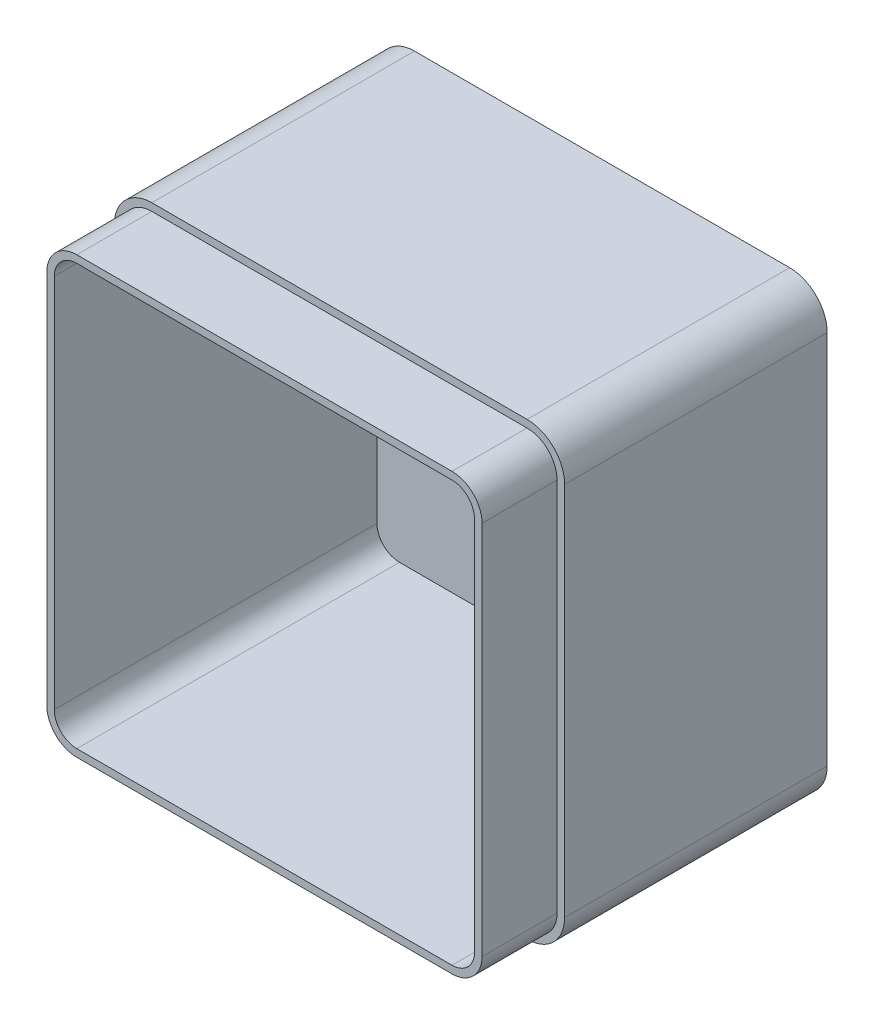
ISO-10303-21;
HEADER;
FILE_DESCRIPTION(('STEP AP214'),'2;1');
FILE_NAME('part.step','',(''),(''),'','','');
FILE_SCHEMA(('AUTOMOTIVE_DESIGN { 1 0 10303 214 1 1 1 1 }'));
ENDSEC;
DATA;
#1=APPLICATION_CONTEXT('core data for automotive mechanical design processes');
#2=APPLICATION_PROTOCOL_DEFINITION('international standard','automotive_design',2000,#1);
#3=PRODUCT_CONTEXT('',#1,'mechanical');
#4=PRODUCT('Part','Part','',(#3));
#5=PRODUCT_RELATED_PRODUCT_CATEGORY('part','',(#4));
#6=PRODUCT_DEFINITION_FORMATION('','',#4);
#7=PRODUCT_DEFINITION_CONTEXT('part definition',#1,'design');
#8=PRODUCT_DEFINITION('design','',#6,#7);
#9=PRODUCT_DEFINITION_SHAPE('','',#8);
#10=(LENGTH_UNIT() NAMED_UNIT(*) SI_UNIT(.MILLI.,.METRE.));
#11=(NAMED_UNIT(*) PLANE_ANGLE_UNIT() SI_UNIT($,.RADIAN.));
#12=(NAMED_UNIT(*) SI_UNIT($,.STERADIAN.) SOLID_ANGLE_UNIT());
#13=UNCERTAINTY_MEASURE_WITH_UNIT(LENGTH_MEASURE(1.E-05),#10,'distance_accuracy_value','');
#14=(GEOMETRIC_REPRESENTATION_CONTEXT(3) GLOBAL_UNCERTAINTY_ASSIGNED_CONTEXT((#13)) GLOBAL_UNIT_ASSIGNED_CONTEXT((#10,
#11,#12)) REPRESENTATION_CONTEXT('',''));
#15=CARTESIAN_POINT('',(0.,0.,0.));
#16=DIRECTION('',(0.,0.,1.));
#17=DIRECTION('',(1.,0.,0.));
#18=AXIS2_PLACEMENT_3D('',#15,#16,#17);
#19=CARTESIAN_POINT('',(0.,0.,4.));
#20=DIRECTION('',(0.,0.,-1.));
#21=DIRECTION('',(-1.,0.,0.));
#22=AXIS2_PLACEMENT_3D('',#19,#20,#21);
#23=PLANE('',#22);
#24=DIRECTION('',(-1.,0.,0.));
#25=VECTOR('',#24,1.);
#26=CARTESIAN_POINT('',(0.,4.,4.));
#27=LINE('',#26,#25);
#28=CARTESIAN_POINT('',(-10.,4.,4.));
#29=VERTEX_POINT('',#28);
#30=CARTESIAN_POINT('',(-110.,4.,4.));
#31=VERTEX_POINT('',#30);
#32=EDGE_CURVE('E805',#29,#31,#27,.T.);
#33=ORIENTED_EDGE('',*,*,#32,.F.);
#34=CARTESIAN_POINT('',(-10.,10.,4.));
#35=DIRECTION('',(0.,0.,-1.));
#36=DIRECTION('',(-1.,0.,0.));
#37=AXIS2_PLACEMENT_3D('',#34,#35,#36);
#38=CIRCLE('',#37,6.);
#39=CARTESIAN_POINT('',(-4.,10.,4.));
#40=VERTEX_POINT('',#39);
#41=EDGE_CURVE('E212',#40,#29,#38,.T.);
#42=ORIENTED_EDGE('',*,*,#41,.F.);
#43=DIRECTION('',(0.,1.,0.));
#44=VECTOR('',#43,1.);
#45=CARTESIAN_POINT('',(-4.,0.,4.));
#46=LINE('',#45,#44);
#47=CARTESIAN_POINT('',(-4.,110.,4.));
#48=VERTEX_POINT('',#47);
#49=EDGE_CURVE('E214',#40,#48,#46,.T.);
#50=ORIENTED_EDGE('',*,*,#49,.T.);
#51=CARTESIAN_POINT('',(-10.,110.,4.));
#52=DIRECTION('',(0.,0.,-1.));
#53=DIRECTION('',(-1.,0.,0.));
#54=AXIS2_PLACEMENT_3D('',#51,#52,#53);
#55=CIRCLE('',#54,6.);
#56=CARTESIAN_POINT('',(-10.,116.,4.));
#57=VERTEX_POINT('',#56);
#58=EDGE_CURVE('E395',#57,#48,#55,.T.);
#59=ORIENTED_EDGE('',*,*,#58,.F.);
#60=DIRECTION('',(-1.,0.,0.));
#61=VECTOR('',#60,1.);
#62=CARTESIAN_POINT('',(0.,116.,4.));
#63=LINE('',#62,#61);
#64=CARTESIAN_POINT('',(-110.,116.,4.));
#65=VERTEX_POINT('',#64);
#66=EDGE_CURVE('E269',#57,#65,#63,.T.);
#67=ORIENTED_EDGE('',*,*,#66,.T.);
#68=CARTESIAN_POINT('',(-110.,110.,4.));
#69=DIRECTION('',(0.,0.,-1.));
#70=DIRECTION('',(-1.,0.,0.));
#71=AXIS2_PLACEMENT_3D('',#68,#69,#70);
#72=CIRCLE('',#71,6.);
#73=CARTESIAN_POINT('',(-116.,110.,4.));
#74=VERTEX_POINT('',#73);
#75=EDGE_CURVE('E796',#74,#65,#72,.T.);
#76=ORIENTED_EDGE('',*,*,#75,.F.);
#77=DIRECTION('',(0.,1.,0.));
#78=VECTOR('',#77,1.);
#79=CARTESIAN_POINT('',(-116.,0.,4.));
#80=LINE('',#79,#78);
#81=CARTESIAN_POINT('',(-116.,10.,4.));
#82=VERTEX_POINT('',#81);
#83=EDGE_CURVE('E370',#82,#74,#80,.T.);
#84=ORIENTED_EDGE('',*,*,#83,.F.);
#85=CARTESIAN_POINT('',(-110.,10.,4.));
#86=DIRECTION('',(0.,0.,-1.));
#87=DIRECTION('',(-1.,0.,0.));
#88=AXIS2_PLACEMENT_3D('',#85,#86,#87);
#89=CIRCLE('',#88,6.);
#90=EDGE_CURVE('E385',#31,#82,#89,.T.);
#91=ORIENTED_EDGE('',*,*,#90,.F.);
#92=EDGE_LOOP('',(#33,#42,#50,#59,#67,#76,#84,#91));
#93=FACE_BOUND('',#92,.T.);
#94=ADVANCED_FACE('F41',(#93),#23,.F.);
#95=CARTESIAN_POINT('',(-110.,10.,70.));
#96=DIRECTION('',(0.,0.,-1.));
#97=DIRECTION('',(-1.,0.,0.));
#98=AXIS2_PLACEMENT_3D('',#95,#96,#97);
#99=CYLINDRICAL_SURFACE('',#98,6.);
#100=DIRECTION('',(0.,0.,1.));
#101=VECTOR('',#100,1.);
#102=CARTESIAN_POINT('',(-116.,10.,70.));
#103=LINE('',#102,#101);
#104=CARTESIAN_POINT('',(-116.,10.,90.));
#105=VERTEX_POINT('',#104);
#106=EDGE_CURVE('E384',#82,#105,#103,.T.);
#107=ORIENTED_EDGE('',*,*,#106,.T.);
#108=CARTESIAN_POINT('',(-110.,10.,90.));
#109=DIRECTION('',(0.,0.,1.));
#110=DIRECTION('',(1.,0.,0.));
#111=AXIS2_PLACEMENT_3D('',#108,#109,#110);
#112=CIRCLE('',#111,6.);
#113=CARTESIAN_POINT('',(-110.,4.,90.));
#114=VERTEX_POINT('',#113);
#115=EDGE_CURVE('E254',#105,#114,#112,.T.);
#116=ORIENTED_EDGE('',*,*,#115,.T.);
#117=DIRECTION('',(0.,0.,-1.));
#118=VECTOR('',#117,1.);
#119=CARTESIAN_POINT('',(-110.,4.,70.));
#120=LINE('',#119,#118);
#121=EDGE_CURVE('E59',#114,#31,#120,.T.);
#122=ORIENTED_EDGE('',*,*,#121,.T.);
#123=ORIENTED_EDGE('',*,*,#90,.T.);
#124=EDGE_LOOP('',(#107,#116,#122,#123));
#125=FACE_BOUND('',#124,.T.);
#126=ADVANCED_FACE('F513',(#125),#99,.F.);
#127=CARTESIAN_POINT('',(-10.,10.,70.));
#128=DIRECTION('',(0.,0.,1.));
#129=DIRECTION('',(1.,0.,0.));
#130=AXIS2_PLACEMENT_3D('',#127,#128,#129);
#131=CYLINDRICAL_SURFACE('',#130,6.);
#132=DIRECTION('',(0.,0.,-1.));
#133=VECTOR('',#132,1.);
#134=CARTESIAN_POINT('',(-10.,4.,70.));
#135=LINE('',#134,#133);
#136=CARTESIAN_POINT('',(-10.,4.,90.));
#137=VERTEX_POINT('',#136);
#138=EDGE_CURVE('E206',#29,#137,#135,.F.);
#139=ORIENTED_EDGE('',*,*,#138,.T.);
#140=CARTESIAN_POINT('',(-10.,10.,90.));
#141=DIRECTION('',(0.,0.,1.));
#142=DIRECTION('',(1.,0.,0.));
#143=AXIS2_PLACEMENT_3D('',#140,#141,#142);
#144=CIRCLE('',#143,6.);
#145=CARTESIAN_POINT('',(-4.,10.,90.));
#146=VERTEX_POINT('',#145);
#147=EDGE_CURVE('E209',#137,#146,#144,.T.);
#148=ORIENTED_EDGE('',*,*,#147,.T.);
#149=DIRECTION('',(0.,0.,1.));
#150=VECTOR('',#149,1.);
#151=CARTESIAN_POINT('',(-4.,10.,70.));
#152=LINE('',#151,#150);
#153=EDGE_CURVE('E45',#146,#40,#152,.F.);
#154=ORIENTED_EDGE('',*,*,#153,.T.);
#155=ORIENTED_EDGE('',*,*,#41,.T.);
#156=EDGE_LOOP('',(#139,#148,#154,#155));
#157=FACE_BOUND('',#156,.T.);
#158=ADVANCED_FACE('F207',(#157),#131,.F.);
#159=CARTESIAN_POINT('',(-10.,110.,70.));
#160=DIRECTION('',(0.,0.,-1.));
#161=DIRECTION('',(-1.,0.,0.));
#162=AXIS2_PLACEMENT_3D('',#159,#160,#161);
#163=CYLINDRICAL_SURFACE('',#162,6.);
#164=DIRECTION('',(0.,0.,1.));
#165=VECTOR('',#164,1.);
#166=CARTESIAN_POINT('',(-4.,110.,70.));
#167=LINE('',#166,#165);
#168=CARTESIAN_POINT('',(-4.,110.,90.));
#169=VERTEX_POINT('',#168);
#170=EDGE_CURVE('E396',#48,#169,#167,.T.);
#171=ORIENTED_EDGE('',*,*,#170,.T.);
#172=CARTESIAN_POINT('',(-10.,110.,90.));
#173=DIRECTION('',(0.,0.,1.));
#174=DIRECTION('',(1.,0.,0.));
#175=AXIS2_PLACEMENT_3D('',#172,#173,#174);
#176=CIRCLE('',#175,5.99999999999999);
#177=CARTESIAN_POINT('',(-10.,116.,90.));
#178=VERTEX_POINT('',#177);
#179=EDGE_CURVE('E228',#169,#178,#176,.T.);
#180=ORIENTED_EDGE('',*,*,#179,.T.);
#181=DIRECTION('',(0.,0.,1.));
#182=VECTOR('',#181,1.);
#183=CARTESIAN_POINT('',(-10.,116.,70.));
#184=LINE('',#183,#182);
#185=EDGE_CURVE('E380',#178,#57,#184,.F.);
#186=ORIENTED_EDGE('',*,*,#185,.T.);
#187=ORIENTED_EDGE('',*,*,#58,.T.);
#188=EDGE_LOOP('',(#171,#180,#186,#187));
#189=FACE_BOUND('',#188,.T.);
#190=ADVANCED_FACE('F527',(#189),#163,.F.);
#191=CARTESIAN_POINT('',(-4.,0.,70.));
#192=DIRECTION('',(-1.,0.,0.));
#193=DIRECTION('',(0.,-1.,0.));
#194=AXIS2_PLACEMENT_3D('',#191,#192,#193);
#195=PLANE('',#194);
#196=ORIENTED_EDGE('',*,*,#49,.F.);
#197=ORIENTED_EDGE('',*,*,#153,.F.);
#198=DIRECTION('',(0.,1.,0.));
#199=VECTOR('',#198,1.);
#200=CARTESIAN_POINT('',(-4.,10.,90.));
#201=LINE('',#200,#199);
#202=EDGE_CURVE('E226',#146,#169,#201,.T.);
#203=ORIENTED_EDGE('',*,*,#202,.T.);
#204=ORIENTED_EDGE('',*,*,#170,.F.);
#205=EDGE_LOOP('',(#196,#197,#203,#204));
#206=FACE_BOUND('',#205,.T.);
#207=ADVANCED_FACE('F522',(#206),#195,.T.);
#208=CARTESIAN_POINT('',(0.,4.,70.));
#209=DIRECTION('',(0.,-1.,0.));
#210=DIRECTION('',(0.,0.,-1.));
#211=AXIS2_PLACEMENT_3D('',#208,#209,#210);
#212=PLANE('',#211);
#213=ORIENTED_EDGE('',*,*,#32,.T.);
#214=ORIENTED_EDGE('',*,*,#121,.F.);
#215=DIRECTION('',(1.,0.,0.));
#216=VECTOR('',#215,1.);
#217=CARTESIAN_POINT('',(-110.,4.,90.));
#218=LINE('',#217,#216);
#219=EDGE_CURVE('E217',#114,#137,#218,.T.);
#220=ORIENTED_EDGE('',*,*,#219,.T.);
#221=ORIENTED_EDGE('',*,*,#138,.F.);
#222=EDGE_LOOP('',(#213,#214,#220,#221));
#223=FACE_BOUND('',#222,.T.);
#224=ADVANCED_FACE('F218',(#223),#212,.F.);
#225=CARTESIAN_POINT('',(-110.,110.,70.));
#226=DIRECTION('',(0.,0.,1.));
#227=DIRECTION('',(1.,0.,0.));
#228=AXIS2_PLACEMENT_3D('',#225,#226,#227);
#229=CYLINDRICAL_SURFACE('',#228,6.);
#230=DIRECTION('',(0.,0.,1.));
#231=VECTOR('',#230,1.);
#232=CARTESIAN_POINT('',(-110.,116.,70.));
#233=LINE('',#232,#231);
#234=CARTESIAN_POINT('',(-110.,116.,90.));
#235=VERTEX_POINT('',#234);
#236=EDGE_CURVE('E376',#65,#235,#233,.T.);
#237=ORIENTED_EDGE('',*,*,#236,.T.);
#238=CARTESIAN_POINT('',(-110.,110.,90.));
#239=DIRECTION('',(0.,0.,1.));
#240=DIRECTION('',(1.,0.,0.));
#241=AXIS2_PLACEMENT_3D('',#238,#239,#240);
#242=CIRCLE('',#241,5.99999999999999);
#243=CARTESIAN_POINT('',(-116.,110.,90.));
#244=VERTEX_POINT('',#243);
#245=EDGE_CURVE('E244',#235,#244,#242,.T.);
#246=ORIENTED_EDGE('',*,*,#245,.T.);
#247=DIRECTION('',(0.,0.,1.));
#248=VECTOR('',#247,1.);
#249=CARTESIAN_POINT('',(-116.,110.,70.));
#250=LINE('',#249,#248);
#251=EDGE_CURVE('E381',#244,#74,#250,.F.);
#252=ORIENTED_EDGE('',*,*,#251,.T.);
#253=ORIENTED_EDGE('',*,*,#75,.T.);
#254=EDGE_LOOP('',(#237,#246,#252,#253));
#255=FACE_BOUND('',#254,.T.);
#256=ADVANCED_FACE('F528',(#255),#229,.F.);
#257=CARTESIAN_POINT('',(-116.,0.,70.));
#258=DIRECTION('',(-1.,0.,0.));
#259=DIRECTION('',(0.,0.,1.));
#260=AXIS2_PLACEMENT_3D('',#257,#258,#259);
#261=PLANE('',#260);
#262=ORIENTED_EDGE('',*,*,#83,.T.);
#263=ORIENTED_EDGE('',*,*,#251,.F.);
#264=DIRECTION('',(0.,-1.,0.));
#265=VECTOR('',#264,1.);
#266=CARTESIAN_POINT('',(-116.,110.,90.));
#267=LINE('',#266,#265);
#268=EDGE_CURVE('E249',#244,#105,#267,.T.);
#269=ORIENTED_EDGE('',*,*,#268,.T.);
#270=ORIENTED_EDGE('',*,*,#106,.F.);
#271=EDGE_LOOP('',(#262,#263,#269,#270));
#272=FACE_BOUND('',#271,.T.);
#273=ADVANCED_FACE('F531',(#272),#261,.F.);
#274=CARTESIAN_POINT('',(0.,116.,70.));
#275=DIRECTION('',(0.,-1.,0.));
#276=DIRECTION('',(1.,0.,0.));
#277=AXIS2_PLACEMENT_3D('',#274,#275,#276);
#278=PLANE('',#277);
#279=ORIENTED_EDGE('',*,*,#66,.F.);
#280=ORIENTED_EDGE('',*,*,#185,.F.);
#281=DIRECTION('',(-1.,0.,0.));
#282=VECTOR('',#281,1.);
#283=CARTESIAN_POINT('',(-10.,116.,90.));
#284=LINE('',#283,#282);
#285=EDGE_CURVE('E239',#178,#235,#284,.T.);
#286=ORIENTED_EDGE('',*,*,#285,.T.);
#287=ORIENTED_EDGE('',*,*,#236,.F.);
#288=EDGE_LOOP('',(#279,#280,#286,#287));
#289=FACE_BOUND('',#288,.T.);
#290=ADVANCED_FACE('F706',(#289),#278,.T.);
#291=CARTESIAN_POINT('',(0.,0.,90.));
#292=DIRECTION('',(0.,0.,1.));
#293=DIRECTION('',(1.,0.,0.));
#294=AXIS2_PLACEMENT_3D('',#291,#292,#293);
#295=PLANE('',#294);
#296=DIRECTION('',(1.,0.,0.));
#297=VECTOR('',#296,1.);
#298=CARTESIAN_POINT('',(-10.,2.,90.));
#299=LINE('',#298,#297);
#300=CARTESIAN_POINT('',(-110.,2.,90.));
#301=VERTEX_POINT('',#300);
#302=CARTESIAN_POINT('',(-10.,2.,90.));
#303=VERTEX_POINT('',#302);
#304=EDGE_CURVE('E221',#301,#303,#299,.T.);
#305=ORIENTED_EDGE('',*,*,#304,.T.);
#306=CARTESIAN_POINT('',(-10.,10.,90.));
#307=DIRECTION('',(0.,0.,1.));
#308=DIRECTION('',(1.,0.,0.));
#309=AXIS2_PLACEMENT_3D('',#306,#307,#308);
#310=CIRCLE('',#309,8.);
#311=CARTESIAN_POINT('',(-2.,10.,90.));
#312=VERTEX_POINT('',#311);
#313=EDGE_CURVE('E270',#303,#312,#310,.T.);
#314=ORIENTED_EDGE('',*,*,#313,.T.);
#315=DIRECTION('',(0.,1.,0.));
#316=VECTOR('',#315,1.);
#317=CARTESIAN_POINT('',(-2.,10.,90.));
#318=LINE('',#317,#316);
#319=CARTESIAN_POINT('',(-2.,110.,90.));
#320=VERTEX_POINT('',#319);
#321=EDGE_CURVE('E277',#312,#320,#318,.T.);
#322=ORIENTED_EDGE('',*,*,#321,.T.);
#323=CARTESIAN_POINT('',(-10.,110.,90.));
#324=DIRECTION('',(0.,0.,1.));
#325=DIRECTION('',(1.,0.,0.));
#326=AXIS2_PLACEMENT_3D('',#323,#324,#325);
#327=CIRCLE('',#326,8.);
#328=CARTESIAN_POINT('',(-10.,118.,90.));
#329=VERTEX_POINT('',#328);
#330=EDGE_CURVE('E297',#320,#329,#327,.T.);
#331=ORIENTED_EDGE('',*,*,#330,.T.);
#332=DIRECTION('',(-1.,0.,0.));
#333=VECTOR('',#332,1.);
#334=CARTESIAN_POINT('',(-10.,118.,90.));
#335=LINE('',#334,#333);
#336=CARTESIAN_POINT('',(-110.,118.,90.));
#337=VERTEX_POINT('',#336);
#338=EDGE_CURVE('E312',#329,#337,#335,.T.);
#339=ORIENTED_EDGE('',*,*,#338,.T.);
#340=CARTESIAN_POINT('',(-110.,110.,90.));
#341=DIRECTION('',(0.,0.,1.));
#342=DIRECTION('',(1.,0.,0.));
#343=AXIS2_PLACEMENT_3D('',#340,#341,#342);
#344=CIRCLE('',#343,7.99999999999999);
#345=CARTESIAN_POINT('',(-118.,110.,90.));
#346=VERTEX_POINT('',#345);
#347=EDGE_CURVE('E326',#337,#346,#344,.T.);
#348=ORIENTED_EDGE('',*,*,#347,.T.);
#349=DIRECTION('',(0.,-1.,0.));
#350=VECTOR('',#349,1.);
#351=CARTESIAN_POINT('',(-118.,10.,90.));
#352=LINE('',#351,#350);
#353=CARTESIAN_POINT('',(-118.,10.,90.));
#354=VERTEX_POINT('',#353);
#355=EDGE_CURVE('E340',#346,#354,#352,.T.);
#356=ORIENTED_EDGE('',*,*,#355,.T.);
#357=CARTESIAN_POINT('',(-110.,10.,90.));
#358=DIRECTION('',(0.,0.,1.));
#359=DIRECTION('',(1.,0.,0.));
#360=AXIS2_PLACEMENT_3D('',#357,#358,#359);
#361=CIRCLE('',#360,8.);
#362=EDGE_CURVE('E259',#354,#301,#361,.T.);
#363=ORIENTED_EDGE('',*,*,#362,.T.);
#364=EDGE_LOOP('',(#305,#314,#322,#331,#339,#348,#356,#363));
#365=FACE_BOUND('',#364,.T.);
#366=ORIENTED_EDGE('',*,*,#219,.F.);
#367=ORIENTED_EDGE('',*,*,#115,.F.);
#368=ORIENTED_EDGE('',*,*,#268,.F.);
#369=ORIENTED_EDGE('',*,*,#245,.F.);
#370=ORIENTED_EDGE('',*,*,#285,.F.);
#371=ORIENTED_EDGE('',*,*,#179,.F.);
#372=ORIENTED_EDGE('',*,*,#202,.F.);
#373=ORIENTED_EDGE('',*,*,#147,.F.);
#374=EDGE_LOOP('',(#366,#367,#368,#369,#370,#371,#372,#373));
#375=FACE_BOUND('',#374,.T.);
#376=ADVANCED_FACE('F223',(#365,#375),#295,.T.);
#377=CARTESIAN_POINT('',(0.,0.,70.));
#378=DIRECTION('',(0.,0.,-1.));
#379=DIRECTION('',(-1.,0.,0.));
#380=AXIS2_PLACEMENT_3D('',#377,#378,#379);
#381=PLANE('',#380);
#382=CARTESIAN_POINT('',(-10.,10.,70.));
#383=DIRECTION('',(0.,0.,1.));
#384=DIRECTION('',(1.,0.,0.));
#385=AXIS2_PLACEMENT_3D('',#382,#383,#384);
#386=CIRCLE('',#385,8.);
#387=CARTESIAN_POINT('',(-10.,2.,70.));
#388=VERTEX_POINT('',#387);
#389=CARTESIAN_POINT('',(-2.,10.,70.));
#390=VERTEX_POINT('',#389);
#391=EDGE_CURVE('E266',#388,#390,#386,.T.);
#392=ORIENTED_EDGE('',*,*,#391,.F.);
#393=DIRECTION('',(1.,0.,0.));
#394=VECTOR('',#393,1.);
#395=CARTESIAN_POINT('',(-10.,2.,70.));
#396=LINE('',#395,#394);
#397=CARTESIAN_POINT('',(-110.,2.,70.));
#398=VERTEX_POINT('',#397);
#399=EDGE_CURVE('E67',#398,#388,#396,.T.);
#400=ORIENTED_EDGE('',*,*,#399,.F.);
#401=CARTESIAN_POINT('',(-110.,10.,70.));
#402=DIRECTION('',(0.,0.,1.));
#403=DIRECTION('',(1.,0.,0.));
#404=AXIS2_PLACEMENT_3D('',#401,#402,#403);
#405=CIRCLE('',#404,8.);
#406=CARTESIAN_POINT('',(-118.,10.,70.));
#407=VERTEX_POINT('',#406);
#408=EDGE_CURVE('E348',#407,#398,#405,.T.);
#409=ORIENTED_EDGE('',*,*,#408,.F.);
#410=DIRECTION('',(0.,-1.,0.));
#411=VECTOR('',#410,1.);
#412=CARTESIAN_POINT('',(-118.,10.,70.));
#413=LINE('',#412,#411);
#414=CARTESIAN_POINT('',(-118.,110.,70.));
#415=VERTEX_POINT('',#414);
#416=EDGE_CURVE('E334',#415,#407,#413,.T.);
#417=ORIENTED_EDGE('',*,*,#416,.F.);
#418=CARTESIAN_POINT('',(-110.,110.,70.));
#419=DIRECTION('',(0.,0.,1.));
#420=DIRECTION('',(1.,0.,0.));
#421=AXIS2_PLACEMENT_3D('',#418,#419,#420);
#422=CIRCLE('',#421,7.99999999999999);
#423=CARTESIAN_POINT('',(-110.,118.,70.));
#424=VERTEX_POINT('',#423);
#425=EDGE_CURVE('E320',#424,#415,#422,.T.);
#426=ORIENTED_EDGE('',*,*,#425,.F.);
#427=DIRECTION('',(-1.,0.,0.));
#428=VECTOR('',#427,1.);
#429=CARTESIAN_POINT('',(-10.,118.,70.));
#430=LINE('',#429,#428);
#431=CARTESIAN_POINT('',(-10.,118.,70.));
#432=VERTEX_POINT('',#431);
#433=EDGE_CURVE('E306',#432,#424,#430,.T.);
#434=ORIENTED_EDGE('',*,*,#433,.F.);
#435=CARTESIAN_POINT('',(-10.,110.,70.));
#436=DIRECTION('',(0.,0.,1.));
#437=DIRECTION('',(1.,0.,0.));
#438=AXIS2_PLACEMENT_3D('',#435,#436,#437);
#439=CIRCLE('',#438,8.);
#440=CARTESIAN_POINT('',(-2.,110.,70.));
#441=VERTEX_POINT('',#440);
#442=EDGE_CURVE('E291',#441,#432,#439,.T.);
#443=ORIENTED_EDGE('',*,*,#442,.F.);
#444=DIRECTION('',(0.,1.,0.));
#445=VECTOR('',#444,1.);
#446=CARTESIAN_POINT('',(-2.,10.,70.));
#447=LINE('',#446,#445);
#448=EDGE_CURVE('E276',#390,#441,#447,.T.);
#449=ORIENTED_EDGE('',*,*,#448,.F.);
#450=EDGE_LOOP('',(#392,#400,#409,#417,#426,#434,#443,#449));
#451=FACE_BOUND('',#450,.T.);
#452=DIRECTION('',(0.,1.,0.));
#453=VECTOR('',#452,1.);
#454=CARTESIAN_POINT('',(-120.,0.,70.));
#455=LINE('',#454,#453);
#456=CARTESIAN_POINT('',(-120.,10.,70.));
#457=VERTEX_POINT('',#456);
#458=CARTESIAN_POINT('',(-120.,110.,70.));
#459=VERTEX_POINT('',#458);
#460=EDGE_CURVE('E405',#457,#459,#455,.T.);
#461=ORIENTED_EDGE('',*,*,#460,.F.);
#462=CARTESIAN_POINT('',(-110.,10.,70.));
#463=DIRECTION('',(0.,0.,-1.));
#464=DIRECTION('',(-1.,0.,0.));
#465=AXIS2_PLACEMENT_3D('',#462,#463,#464);
#466=CIRCLE('',#465,10.);
#467=CARTESIAN_POINT('',(-110.,0.,70.));
#468=VERTEX_POINT('',#467);
#469=EDGE_CURVE('E450',#457,#468,#466,.F.);
#470=ORIENTED_EDGE('',*,*,#469,.T.);
#471=DIRECTION('',(-1.,0.,0.));
#472=VECTOR('',#471,1.);
#473=CARTESIAN_POINT('',(0.,0.,70.));
#474=LINE('',#473,#472);
#475=CARTESIAN_POINT('',(-10.,0.,70.));
#476=VERTEX_POINT('',#475);
#477=EDGE_CURVE('E409',#476,#468,#474,.T.);
#478=ORIENTED_EDGE('',*,*,#477,.F.);
#479=CARTESIAN_POINT('',(-10.,10.,70.));
#480=DIRECTION('',(0.,0.,-1.));
#481=DIRECTION('',(-1.,0.,0.));
#482=AXIS2_PLACEMENT_3D('',#479,#480,#481);
#483=CIRCLE('',#482,10.);
#484=CARTESIAN_POINT('',(0.,10.,70.));
#485=VERTEX_POINT('',#484);
#486=EDGE_CURVE('E448',#476,#485,#483,.F.);
#487=ORIENTED_EDGE('',*,*,#486,.T.);
#488=DIRECTION('',(0.,1.,0.));
#489=VECTOR('',#488,1.);
#490=CARTESIAN_POINT('',(0.,0.,70.));
#491=LINE('',#490,#489);
#492=CARTESIAN_POINT('',(0.,110.,70.));
#493=VERTEX_POINT('',#492);
#494=EDGE_CURVE('E412',#485,#493,#491,.T.);
#495=ORIENTED_EDGE('',*,*,#494,.T.);
#496=CARTESIAN_POINT('',(-10.,110.,70.));
#497=DIRECTION('',(0.,0.,-1.));
#498=DIRECTION('',(-1.,0.,0.));
#499=AXIS2_PLACEMENT_3D('',#496,#497,#498);
#500=CIRCLE('',#499,10.);
#501=CARTESIAN_POINT('',(-10.,120.,70.));
#502=VERTEX_POINT('',#501);
#503=EDGE_CURVE('E444',#493,#502,#500,.F.);
#504=ORIENTED_EDGE('',*,*,#503,.T.);
#505=DIRECTION('',(-1.,0.,0.));
#506=VECTOR('',#505,1.);
#507=CARTESIAN_POINT('',(0.,120.,70.));
#508=LINE('',#507,#506);
#509=CARTESIAN_POINT('',(-110.,120.,70.));
#510=VERTEX_POINT('',#509);
#511=EDGE_CURVE('E402',#502,#510,#508,.T.);
#512=ORIENTED_EDGE('',*,*,#511,.T.);
#513=CARTESIAN_POINT('',(-110.,110.,70.));
#514=DIRECTION('',(0.,0.,-1.));
#515=DIRECTION('',(-1.,0.,0.));
#516=AXIS2_PLACEMENT_3D('',#513,#514,#515);
#517=CIRCLE('',#516,10.);
#518=EDGE_CURVE('E446',#510,#459,#517,.F.);
#519=ORIENTED_EDGE('',*,*,#518,.T.);
#520=EDGE_LOOP('',(#461,#470,#478,#487,#495,#504,#512,#519));
#521=FACE_BOUND('',#520,.T.);
#522=ADVANCED_FACE('F482',(#451,#521),#381,.F.);
#523=CARTESIAN_POINT('',(0.,120.,70.));
#524=DIRECTION('',(0.,-1.,0.));
#525=DIRECTION('',(1.,0.,0.));
#526=AXIS2_PLACEMENT_3D('',#523,#524,#525);
#527=PLANE('',#526);
#528=DIRECTION('',(-1.,0.,0.));
#529=VECTOR('',#528,1.);
#530=CARTESIAN_POINT('',(0.,120.,0.));
#531=LINE('',#530,#529);
#532=CARTESIAN_POINT('',(-10.,120.,0.));
#533=VERTEX_POINT('',#532);
#534=CARTESIAN_POINT('',(-110.,120.,0.));
#535=VERTEX_POINT('',#534);
#536=EDGE_CURVE('E379',#533,#535,#531,.T.);
#537=ORIENTED_EDGE('',*,*,#536,.T.);
#538=DIRECTION('',(0.,0.,-1.));
#539=VECTOR('',#538,1.);
#540=CARTESIAN_POINT('',(-110.,120.,70.));
#541=LINE('',#540,#539);
#542=EDGE_CURVE('E12',#535,#510,#541,.F.);
#543=ORIENTED_EDGE('',*,*,#542,.T.);
#544=ORIENTED_EDGE('',*,*,#511,.F.);
#545=DIRECTION('',(0.,0.,-1.));
#546=VECTOR('',#545,1.);
#547=CARTESIAN_POINT('',(-10.,120.,70.));
#548=LINE('',#547,#546);
#549=EDGE_CURVE('E51',#502,#533,#548,.T.);
#550=ORIENTED_EDGE('',*,*,#549,.T.);
#551=EDGE_LOOP('',(#537,#543,#544,#550));
#552=FACE_BOUND('',#551,.T.);
#553=ADVANCED_FACE('F464',(#552),#527,.F.);
#554=CARTESIAN_POINT('',(-120.,0.,70.));
#555=DIRECTION('',(-1.,0.,0.));
#556=DIRECTION('',(0.,0.,1.));
#557=AXIS2_PLACEMENT_3D('',#554,#555,#556);
#558=PLANE('',#557);
#559=DIRECTION('',(0.,1.,0.));
#560=VECTOR('',#559,1.);
#561=CARTESIAN_POINT('',(-120.,0.,0.));
#562=LINE('',#561,#560);
#563=CARTESIAN_POINT('',(-120.,10.,0.));
#564=VERTEX_POINT('',#563);
#565=CARTESIAN_POINT('',(-120.,110.,0.));
#566=VERTEX_POINT('',#565);
#567=EDGE_CURVE('E419',#564,#566,#562,.T.);
#568=ORIENTED_EDGE('',*,*,#567,.F.);
#569=DIRECTION('',(0.,0.,-1.));
#570=VECTOR('',#569,1.);
#571=CARTESIAN_POINT('',(-120.,10.,70.));
#572=LINE('',#571,#570);
#573=EDGE_CURVE('E442',#564,#457,#572,.F.);
#574=ORIENTED_EDGE('',*,*,#573,.T.);
#575=ORIENTED_EDGE('',*,*,#460,.T.);
#576=DIRECTION('',(0.,0.,-1.));
#577=VECTOR('',#576,1.);
#578=CARTESIAN_POINT('',(-120.,110.,0.));
#579=LINE('',#578,#577);
#580=EDGE_CURVE('E439',#459,#566,#579,.T.);
#581=ORIENTED_EDGE('',*,*,#580,.T.);
#582=EDGE_LOOP('',(#568,#574,#575,#581));
#583=FACE_BOUND('',#582,.T.);
#584=ADVANCED_FACE('F477',(#583),#558,.T.);
#585=CARTESIAN_POINT('',(0.,0.,70.));
#586=DIRECTION('',(0.,-1.,0.));
#587=DIRECTION('',(0.,0.,-1.));
#588=AXIS2_PLACEMENT_3D('',#585,#586,#587);
#589=PLANE('',#588);
#590=ORIENTED_EDGE('',*,*,#477,.T.);
#591=DIRECTION('',(0.,0.,-1.));
#592=VECTOR('',#591,1.);
#593=CARTESIAN_POINT('',(-110.,0.,70.));
#594=LINE('',#593,#592);
#595=CARTESIAN_POINT('',(-110.,0.,0.));
#596=VERTEX_POINT('',#595);
#597=EDGE_CURVE('E428',#468,#596,#594,.T.);
#598=ORIENTED_EDGE('',*,*,#597,.T.);
#599=DIRECTION('',(-1.,0.,0.));
#600=VECTOR('',#599,1.);
#601=CARTESIAN_POINT('',(0.,0.,0.));
#602=LINE('',#601,#600);
#603=CARTESIAN_POINT('',(-10.,0.,0.));
#604=VERTEX_POINT('',#603);
#605=EDGE_CURVE('E422',#604,#596,#602,.T.);
#606=ORIENTED_EDGE('',*,*,#605,.F.);
#607=DIRECTION('',(0.,0.,-1.));
#608=VECTOR('',#607,1.);
#609=CARTESIAN_POINT('',(-10.,0.,70.));
#610=LINE('',#609,#608);
#611=EDGE_CURVE('E415',#604,#476,#610,.F.);
#612=ORIENTED_EDGE('',*,*,#611,.T.);
#613=EDGE_LOOP('',(#590,#598,#606,#612));
#614=FACE_BOUND('',#613,.T.);
#615=ADVANCED_FACE('F489',(#614),#589,.T.);
#616=CARTESIAN_POINT('',(0.,0.,70.));
#617=DIRECTION('',(-1.,0.,0.));
#618=DIRECTION('',(0.,-1.,0.));
#619=AXIS2_PLACEMENT_3D('',#616,#617,#618);
#620=PLANE('',#619);
#621=ORIENTED_EDGE('',*,*,#494,.F.);
#622=DIRECTION('',(0.,0.,-1.));
#623=VECTOR('',#622,1.);
#624=CARTESIAN_POINT('',(0.,10.,0.));
#625=LINE('',#624,#623);
#626=CARTESIAN_POINT('',(0.,10.,0.));
#627=VERTEX_POINT('',#626);
#628=EDGE_CURVE('E454',#485,#627,#625,.T.);
#629=ORIENTED_EDGE('',*,*,#628,.T.);
#630=DIRECTION('',(0.,1.,0.));
#631=VECTOR('',#630,1.);
#632=CARTESIAN_POINT('',(0.,0.,0.));
#633=LINE('',#632,#631);
#634=CARTESIAN_POINT('',(0.,110.,0.));
#635=VERTEX_POINT('',#634);
#636=EDGE_CURVE('E406',#627,#635,#633,.T.);
#637=ORIENTED_EDGE('',*,*,#636,.T.);
#638=DIRECTION('',(0.,0.,-1.));
#639=VECTOR('',#638,1.);
#640=CARTESIAN_POINT('',(0.,110.,70.));
#641=LINE('',#640,#639);
#642=EDGE_CURVE('E452',#635,#493,#641,.F.);
#643=ORIENTED_EDGE('',*,*,#642,.T.);
#644=EDGE_LOOP('',(#621,#629,#637,#643));
#645=FACE_BOUND('',#644,.T.);
#646=ADVANCED_FACE('F497',(#645),#620,.F.);
#647=CARTESIAN_POINT('',(0.,0.,0.));
#648=DIRECTION('',(0.,0.,-1.));
#649=DIRECTION('',(-1.,0.,0.));
#650=AXIS2_PLACEMENT_3D('',#647,#648,#649);
#651=PLANE('',#650);
#652=ORIENTED_EDGE('',*,*,#605,.T.);
#653=CARTESIAN_POINT('',(-110.,10.,0.));
#654=DIRECTION('',(0.,0.,-1.));
#655=DIRECTION('',(-1.,0.,0.));
#656=AXIS2_PLACEMENT_3D('',#653,#654,#655);
#657=CIRCLE('',#656,10.);
#658=EDGE_CURVE('E437',#596,#564,#657,.T.);
#659=ORIENTED_EDGE('',*,*,#658,.T.);
#660=ORIENTED_EDGE('',*,*,#567,.T.);
#661=CARTESIAN_POINT('',(-110.,110.,0.));
#662=DIRECTION('',(0.,0.,-1.));
#663=DIRECTION('',(-1.,0.,0.));
#664=AXIS2_PLACEMENT_3D('',#661,#662,#663);
#665=CIRCLE('',#664,10.);
#666=EDGE_CURVE('E433',#566,#535,#665,.T.);
#667=ORIENTED_EDGE('',*,*,#666,.T.);
#668=ORIENTED_EDGE('',*,*,#536,.F.);
#669=CARTESIAN_POINT('',(-10.,110.,0.));
#670=DIRECTION('',(0.,0.,-1.));
#671=DIRECTION('',(-1.,0.,0.));
#672=AXIS2_PLACEMENT_3D('',#669,#670,#671);
#673=CIRCLE('',#672,10.);
#674=EDGE_CURVE('E431',#533,#635,#673,.T.);
#675=ORIENTED_EDGE('',*,*,#674,.T.);
#676=ORIENTED_EDGE('',*,*,#636,.F.);
#677=CARTESIAN_POINT('',(-10.,10.,0.));
#678=DIRECTION('',(0.,0.,-1.));
#679=DIRECTION('',(-1.,0.,0.));
#680=AXIS2_PLACEMENT_3D('',#677,#678,#679);
#681=CIRCLE('',#680,10.);
#682=EDGE_CURVE('E435',#627,#604,#681,.T.);
#683=ORIENTED_EDGE('',*,*,#682,.T.);
#684=EDGE_LOOP('',(#652,#659,#660,#667,#668,#675,#676,#683));
#685=FACE_BOUND('',#684,.T.);
#686=ADVANCED_FACE('F469',(#685),#651,.T.);
#687=CARTESIAN_POINT('',(-110.,10.,70.));
#688=DIRECTION('',(0.,0.,-1.));
#689=DIRECTION('',(-1.,0.,0.));
#690=AXIS2_PLACEMENT_3D('',#687,#688,#689);
#691=CYLINDRICAL_SURFACE('',#690,10.);
#692=ORIENTED_EDGE('',*,*,#469,.F.);
#693=ORIENTED_EDGE('',*,*,#573,.F.);
#694=ORIENTED_EDGE('',*,*,#658,.F.);
#695=ORIENTED_EDGE('',*,*,#597,.F.);
#696=EDGE_LOOP('',(#692,#693,#694,#695));
#697=FACE_BOUND('',#696,.T.);
#698=ADVANCED_FACE('F486',(#697),#691,.T.);
#699=CARTESIAN_POINT('',(-10.,10.,70.));
#700=DIRECTION('',(0.,0.,1.));
#701=DIRECTION('',(1.,0.,0.));
#702=AXIS2_PLACEMENT_3D('',#699,#700,#701);
#703=CYLINDRICAL_SURFACE('',#702,10.);
#704=ORIENTED_EDGE('',*,*,#486,.F.);
#705=ORIENTED_EDGE('',*,*,#611,.F.);
#706=ORIENTED_EDGE('',*,*,#682,.F.);
#707=ORIENTED_EDGE('',*,*,#628,.F.);
#708=EDGE_LOOP('',(#704,#705,#706,#707));
#709=FACE_BOUND('',#708,.T.);
#710=ADVANCED_FACE('F494',(#709),#703,.T.);
#711=CARTESIAN_POINT('',(-110.,110.,70.));
#712=DIRECTION('',(0.,0.,1.));
#713=DIRECTION('',(1.,0.,0.));
#714=AXIS2_PLACEMENT_3D('',#711,#712,#713);
#715=CYLINDRICAL_SURFACE('',#714,10.);
#716=ORIENTED_EDGE('',*,*,#518,.F.);
#717=ORIENTED_EDGE('',*,*,#542,.F.);
#718=ORIENTED_EDGE('',*,*,#666,.F.);
#719=ORIENTED_EDGE('',*,*,#580,.F.);
#720=EDGE_LOOP('',(#716,#717,#718,#719));
#721=FACE_BOUND('',#720,.T.);
#722=ADVANCED_FACE('F475',(#721),#715,.T.);
#723=CARTESIAN_POINT('',(-10.,110.,70.));
#724=DIRECTION('',(0.,0.,-1.));
#725=DIRECTION('',(-1.,0.,0.));
#726=AXIS2_PLACEMENT_3D('',#723,#724,#725);
#727=CYLINDRICAL_SURFACE('',#726,10.);
#728=ORIENTED_EDGE('',*,*,#503,.F.);
#729=ORIENTED_EDGE('',*,*,#642,.F.);
#730=ORIENTED_EDGE('',*,*,#674,.F.);
#731=ORIENTED_EDGE('',*,*,#549,.F.);
#732=EDGE_LOOP('',(#728,#729,#730,#731));
#733=FACE_BOUND('',#732,.T.);
#734=ADVANCED_FACE('F43',(#733),#727,.T.);
#735=CARTESIAN_POINT('',(-10.,2.,70.));
#736=DIRECTION('',(0.,-1.,0.));
#737=DIRECTION('',(0.,0.,-1.));
#738=AXIS2_PLACEMENT_3D('',#735,#736,#737);
#739=PLANE('',#738);
#740=ORIENTED_EDGE('',*,*,#304,.F.);
#741=DIRECTION('',(0.,0.,1.));
#742=VECTOR('',#741,1.);
#743=CARTESIAN_POINT('',(-110.,2.,70.));
#744=LINE('',#743,#742);
#745=EDGE_CURVE('E263',#398,#301,#744,.T.);
#746=ORIENTED_EDGE('',*,*,#745,.F.);
#747=ORIENTED_EDGE('',*,*,#399,.T.);
#748=DIRECTION('',(0.,0.,1.));
#749=VECTOR('',#748,1.);
#750=CARTESIAN_POINT('',(-10.,2.,70.));
#751=LINE('',#750,#749);
#752=EDGE_CURVE('E257',#388,#303,#751,.T.);
#753=ORIENTED_EDGE('',*,*,#752,.T.);
#754=EDGE_LOOP('',(#740,#746,#747,#753));
#755=FACE_BOUND('',#754,.T.);
#756=ADVANCED_FACE('F500',(#755),#739,.T.);
#757=CARTESIAN_POINT('',(-110.,10.,70.));
#758=DIRECTION('',(0.,0.,1.));
#759=DIRECTION('',(1.,0.,0.));
#760=AXIS2_PLACEMENT_3D('',#757,#758,#759);
#761=CYLINDRICAL_SURFACE('',#760,8.);
#762=ORIENTED_EDGE('',*,*,#362,.F.);
#763=DIRECTION('',(0.,0.,1.));
#764=VECTOR('',#763,1.);
#765=CARTESIAN_POINT('',(-118.,10.,70.));
#766=LINE('',#765,#764);
#767=EDGE_CURVE('E351',#407,#354,#766,.T.);
#768=ORIENTED_EDGE('',*,*,#767,.F.);
#769=ORIENTED_EDGE('',*,*,#408,.T.);
#770=ORIENTED_EDGE('',*,*,#745,.T.);
#771=EDGE_LOOP('',(#762,#768,#769,#770));
#772=FACE_BOUND('',#771,.T.);
#773=ADVANCED_FACE('F506',(#772),#761,.T.);
#774=CARTESIAN_POINT('',(-118.,10.,70.));
#775=DIRECTION('',(-1.,0.,0.));
#776=DIRECTION('',(0.,0.,1.));
#777=AXIS2_PLACEMENT_3D('',#774,#775,#776);
#778=PLANE('',#777);
#779=ORIENTED_EDGE('',*,*,#355,.F.);
#780=DIRECTION('',(0.,0.,1.));
#781=VECTOR('',#780,1.);
#782=CARTESIAN_POINT('',(-118.,110.,70.));
#783=LINE('',#782,#781);
#784=EDGE_CURVE('E337',#415,#346,#783,.T.);
#785=ORIENTED_EDGE('',*,*,#784,.F.);
#786=ORIENTED_EDGE('',*,*,#416,.T.);
#787=ORIENTED_EDGE('',*,*,#767,.T.);
#788=EDGE_LOOP('',(#779,#785,#786,#787));
#789=FACE_BOUND('',#788,.T.);
#790=ADVANCED_FACE('F600',(#789),#778,.T.);
#791=CARTESIAN_POINT('',(-110.,110.,70.));
#792=DIRECTION('',(0.,0.,1.));
#793=DIRECTION('',(1.,0.,0.));
#794=AXIS2_PLACEMENT_3D('',#791,#792,#793);
#795=CYLINDRICAL_SURFACE('',#794,7.99999999999999);
#796=ORIENTED_EDGE('',*,*,#347,.F.);
#797=DIRECTION('',(0.,0.,1.));
#798=VECTOR('',#797,1.);
#799=CARTESIAN_POINT('',(-110.,118.,70.));
#800=LINE('',#799,#798);
#801=EDGE_CURVE('E323',#424,#337,#800,.T.);
#802=ORIENTED_EDGE('',*,*,#801,.F.);
#803=ORIENTED_EDGE('',*,*,#425,.T.);
#804=ORIENTED_EDGE('',*,*,#784,.T.);
#805=EDGE_LOOP('',(#796,#802,#803,#804));
#806=FACE_BOUND('',#805,.T.);
#807=ADVANCED_FACE('F610',(#806),#795,.T.);
#808=CARTESIAN_POINT('',(-10.,118.,70.));
#809=DIRECTION('',(0.,1.,0.));
#810=DIRECTION('',(-1.,0.,0.));
#811=AXIS2_PLACEMENT_3D('',#808,#809,#810);
#812=PLANE('',#811);
#813=ORIENTED_EDGE('',*,*,#338,.F.);
#814=DIRECTION('',(0.,0.,1.));
#815=VECTOR('',#814,1.);
#816=CARTESIAN_POINT('',(-10.,118.,70.));
#817=LINE('',#816,#815);
#818=EDGE_CURVE('E309',#432,#329,#817,.T.);
#819=ORIENTED_EDGE('',*,*,#818,.F.);
#820=ORIENTED_EDGE('',*,*,#433,.T.);
#821=ORIENTED_EDGE('',*,*,#801,.T.);
#822=EDGE_LOOP('',(#813,#819,#820,#821));
#823=FACE_BOUND('',#822,.T.);
#824=ADVANCED_FACE('F620',(#823),#812,.T.);
#825=CARTESIAN_POINT('',(-10.,110.,70.));
#826=DIRECTION('',(0.,0.,1.));
#827=DIRECTION('',(1.,0.,0.));
#828=AXIS2_PLACEMENT_3D('',#825,#826,#827);
#829=CYLINDRICAL_SURFACE('',#828,8.);
#830=ORIENTED_EDGE('',*,*,#330,.F.);
#831=DIRECTION('',(0.,0.,1.));
#832=VECTOR('',#831,1.);
#833=CARTESIAN_POINT('',(-2.,110.,70.));
#834=LINE('',#833,#832);
#835=EDGE_CURVE('E294',#441,#320,#834,.T.);
#836=ORIENTED_EDGE('',*,*,#835,.F.);
#837=ORIENTED_EDGE('',*,*,#442,.T.);
#838=ORIENTED_EDGE('',*,*,#818,.T.);
#839=EDGE_LOOP('',(#830,#836,#837,#838));
#840=FACE_BOUND('',#839,.T.);
#841=ADVANCED_FACE('F630',(#840),#829,.T.);
#842=CARTESIAN_POINT('',(-2.,10.,70.));
#843=DIRECTION('',(1.,0.,0.));
#844=DIRECTION('',(0.,0.,-1.));
#845=AXIS2_PLACEMENT_3D('',#842,#843,#844);
#846=PLANE('',#845);
#847=ORIENTED_EDGE('',*,*,#321,.F.);
#848=DIRECTION('',(0.,0.,1.));
#849=VECTOR('',#848,1.);
#850=CARTESIAN_POINT('',(-2.,10.,70.));
#851=LINE('',#850,#849);
#852=EDGE_CURVE('E273',#390,#312,#851,.T.);
#853=ORIENTED_EDGE('',*,*,#852,.F.);
#854=ORIENTED_EDGE('',*,*,#448,.T.);
#855=ORIENTED_EDGE('',*,*,#835,.T.);
#856=EDGE_LOOP('',(#847,#853,#854,#855));
#857=FACE_BOUND('',#856,.T.);
#858=ADVANCED_FACE('F509',(#857),#846,.T.);
#859=CARTESIAN_POINT('',(-10.,10.,70.));
#860=DIRECTION('',(0.,0.,1.));
#861=DIRECTION('',(1.,0.,0.));
#862=AXIS2_PLACEMENT_3D('',#859,#860,#861);
#863=CYLINDRICAL_SURFACE('',#862,8.);
#864=ORIENTED_EDGE('',*,*,#313,.F.);
#865=ORIENTED_EDGE('',*,*,#752,.F.);
#866=ORIENTED_EDGE('',*,*,#391,.T.);
#867=ORIENTED_EDGE('',*,*,#852,.T.);
#868=EDGE_LOOP('',(#864,#865,#866,#867));
#869=FACE_BOUND('',#868,.T.);
#870=ADVANCED_FACE('F501',(#869),#863,.T.);
#871=CLOSED_SHELL('',(#94,#126,#158,#190,#207,#224,#256,#273,#290,#376,#522,#553,#584,#615,#646,
#686,#698,#710,#722,#734,#756,#773,#790,#807,#824,#841,#858,#870));
#872=MANIFOLD_SOLID_BREP('B2',#871);
#873=ADVANCED_BREP_SHAPE_REPRESENTATION('',(#18,#872),#14);
#874=SHAPE_DEFINITION_REPRESENTATION(#9,#873);
ENDSEC;
END-ISO-10303-21;
